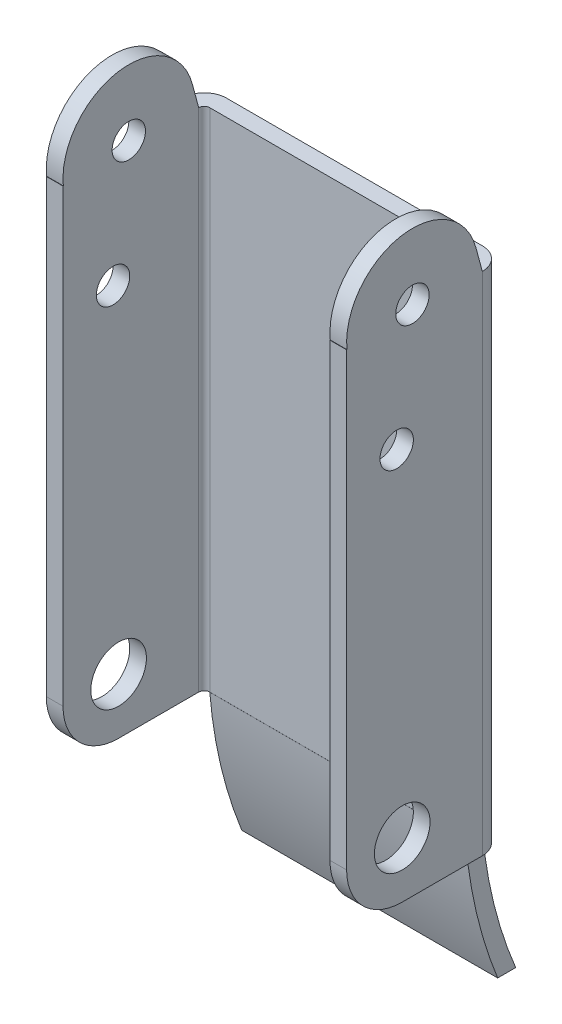
ISO-10303-21;
HEADER;
FILE_DESCRIPTION(('STEP AP214'),'2;1');
FILE_NAME('part.step','',(''),(''),'','','');
FILE_SCHEMA(('AUTOMOTIVE_DESIGN { 1 0 10303 214 1 1 1 1 }'));
ENDSEC;
DATA;
#1=APPLICATION_CONTEXT('core data for automotive mechanical design processes');
#2=APPLICATION_PROTOCOL_DEFINITION('international standard','automotive_design',2000,#1);
#3=PRODUCT_CONTEXT('',#1,'mechanical');
#4=PRODUCT('Part','Part','',(#3));
#5=PRODUCT_RELATED_PRODUCT_CATEGORY('part','',(#4));
#6=PRODUCT_DEFINITION_FORMATION('','',#4);
#7=PRODUCT_DEFINITION_CONTEXT('part definition',#1,'design');
#8=PRODUCT_DEFINITION('design','',#6,#7);
#9=PRODUCT_DEFINITION_SHAPE('','',#8);
#10=(LENGTH_UNIT() NAMED_UNIT(*) SI_UNIT(.MILLI.,.METRE.));
#11=(NAMED_UNIT(*) PLANE_ANGLE_UNIT() SI_UNIT($,.RADIAN.));
#12=(NAMED_UNIT(*) SI_UNIT($,.STERADIAN.) SOLID_ANGLE_UNIT());
#13=UNCERTAINTY_MEASURE_WITH_UNIT(LENGTH_MEASURE(1.E-05),#10,'distance_accuracy_value','');
#14=(GEOMETRIC_REPRESENTATION_CONTEXT(3) GLOBAL_UNCERTAINTY_ASSIGNED_CONTEXT((#13)) GLOBAL_UNIT_ASSIGNED_CONTEXT((#10,
#11,#12)) REPRESENTATION_CONTEXT('',''));
#15=CARTESIAN_POINT('',(0.,0.,0.));
#16=DIRECTION('',(0.,0.,1.));
#17=DIRECTION('',(1.,0.,0.));
#18=AXIS2_PLACEMENT_3D('',#15,#16,#17);
#19=CARTESIAN_POINT('',(11.5,0.,-12.2));
#20=DIRECTION('',(0.,1.,0.));
#21=DIRECTION('',(0.,0.,1.));
#22=AXIS2_PLACEMENT_3D('',#19,#20,#21);
#23=PLANE('',#22);
#24=DIRECTION('',(0.,0.,1.));
#25=VECTOR('',#24,1.);
#26=CARTESIAN_POINT('',(-11.5,0.,-12.6946454711369));
#27=LINE('',#26,#25);
#28=CARTESIAN_POINT('',(-11.5,0.,-14.2));
#29=VERTEX_POINT('',#28);
#30=CARTESIAN_POINT('',(-11.5,0.,-12.7));
#31=VERTEX_POINT('',#30);
#32=EDGE_CURVE('E183',#29,#31,#27,.T.);
#33=ORIENTED_EDGE('',*,*,#32,.T.);
#34=CARTESIAN_POINT('',(-11.5,0.,-12.2));
#35=DIRECTION('',(0.,-1.,0.));
#36=DIRECTION('',(0.,0.,1.));
#37=AXIS2_PLACEMENT_3D('',#34,#35,#36);
#38=CIRCLE('',#37,0.5);
#39=CARTESIAN_POINT('',(-12.,0.,-12.2));
#40=VERTEX_POINT('',#39);
#41=EDGE_CURVE('E355',#40,#31,#38,.T.);
#42=ORIENTED_EDGE('',*,*,#41,.F.);
#43=DIRECTION('',(0.,0.,-1.));
#44=VECTOR('',#43,1.);
#45=CARTESIAN_POINT('',(-12.,0.,0.));
#46=LINE('',#45,#44);
#47=CARTESIAN_POINT('',(-12.,0.,-5.00000000000004));
#48=VERTEX_POINT('',#47);
#49=EDGE_CURVE('E352',#48,#40,#46,.T.);
#50=ORIENTED_EDGE('',*,*,#49,.F.);
#51=DIRECTION('',(1.,0.,0.));
#52=VECTOR('',#51,1.);
#53=CARTESIAN_POINT('',(-26.,0.,-5.));
#54=LINE('',#53,#52);
#55=CARTESIAN_POINT('',(-13.5,0.,-5.));
#56=VERTEX_POINT('',#55);
#57=EDGE_CURVE('E391',#48,#56,#54,.F.);
#58=ORIENTED_EDGE('',*,*,#57,.T.);
#59=DIRECTION('',(0.,0.,1.));
#60=VECTOR('',#59,1.);
#61=CARTESIAN_POINT('',(-13.5,0.,0.));
#62=LINE('',#61,#60);
#63=CARTESIAN_POINT('',(-13.5,0.,-12.2));
#64=VERTEX_POINT('',#63);
#65=EDGE_CURVE('E186',#64,#56,#62,.T.);
#66=ORIENTED_EDGE('',*,*,#65,.F.);
#67=CARTESIAN_POINT('',(-11.5,0.,-12.2));
#68=DIRECTION('',(0.,1.,0.));
#69=DIRECTION('',(0.,0.,1.));
#70=AXIS2_PLACEMENT_3D('',#67,#68,#69);
#71=CIRCLE('',#70,2.);
#72=EDGE_CURVE('E179',#29,#64,#71,.T.);
#73=ORIENTED_EDGE('',*,*,#72,.F.);
#74=EDGE_LOOP('',(#33,#42,#50,#58,#66,#73));
#75=FACE_BOUND('',#74,.T.);
#76=ADVANCED_FACE('F35',(#75),#23,.F.);
#77=CARTESIAN_POINT('',(12.,52.,0.));
#78=DIRECTION('',(0.,0.,-1.));
#79=DIRECTION('',(-1.,0.,0.));
#80=AXIS2_PLACEMENT_3D('',#77,#78,#79);
#81=PLANE('',#80);
#82=DIRECTION('',(1.,0.,0.));
#83=VECTOR('',#82,1.);
#84=CARTESIAN_POINT('',(-26.,5.00000000000003,0.));
#85=LINE('',#84,#83);
#86=CARTESIAN_POINT('',(12.,5.00000000000003,0.));
#87=VERTEX_POINT('',#86);
#88=CARTESIAN_POINT('',(13.5,5.00000000000003,0.));
#89=VERTEX_POINT('',#88);
#90=EDGE_CURVE('E249',#87,#89,#85,.T.);
#91=ORIENTED_EDGE('',*,*,#90,.T.);
#92=DIRECTION('',(0.,-1.,0.));
#93=VECTOR('',#92,1.);
#94=CARTESIAN_POINT('',(13.5,52.,0.));
#95=LINE('',#94,#93);
#96=CARTESIAN_POINT('',(13.5,45.5,0.));
#97=VERTEX_POINT('',#96);
#98=EDGE_CURVE('E388',#97,#89,#95,.T.);
#99=ORIENTED_EDGE('',*,*,#98,.F.);
#100=DIRECTION('',(-1.,0.,0.));
#101=VECTOR('',#100,1.);
#102=CARTESIAN_POINT('',(12.,45.5,0.));
#103=LINE('',#102,#101);
#104=CARTESIAN_POINT('',(12.,45.5,0.));
#105=VERTEX_POINT('',#104);
#106=EDGE_CURVE('E279',#97,#105,#103,.T.);
#107=ORIENTED_EDGE('',*,*,#106,.T.);
#108=DIRECTION('',(0.,-1.,0.));
#109=VECTOR('',#108,1.);
#110=CARTESIAN_POINT('',(12.,52.,0.));
#111=LINE('',#110,#109);
#112=EDGE_CURVE('E367',#105,#87,#111,.T.);
#113=ORIENTED_EDGE('',*,*,#112,.T.);
#114=EDGE_LOOP('',(#91,#99,#107,#113));
#115=FACE_BOUND('',#114,.T.);
#116=ADVANCED_FACE('F37',(#115),#81,.F.);
#117=CARTESIAN_POINT('',(-12.,52.,0.));
#118=DIRECTION('',(0.,0.,-1.));
#119=DIRECTION('',(-1.,0.,0.));
#120=AXIS2_PLACEMENT_3D('',#117,#118,#119);
#121=PLANE('',#120);
#122=CARTESIAN_POINT('',(-13.5,5.00000000000003,0.));
#123=VERTEX_POINT('',#122);
#124=CARTESIAN_POINT('',(-12.,5.00000000000003,0.));
#125=VERTEX_POINT('',#124);
#126=EDGE_CURVE('E252',#123,#125,#85,.T.);
#127=ORIENTED_EDGE('',*,*,#126,.T.);
#128=DIRECTION('',(0.,-1.,0.));
#129=VECTOR('',#128,1.);
#130=CARTESIAN_POINT('',(-12.,52.,0.));
#131=LINE('',#130,#129);
#132=CARTESIAN_POINT('',(-12.,45.5,0.));
#133=VERTEX_POINT('',#132);
#134=EDGE_CURVE('E378',#133,#125,#131,.T.);
#135=ORIENTED_EDGE('',*,*,#134,.F.);
#136=DIRECTION('',(-1.,0.,0.));
#137=VECTOR('',#136,1.);
#138=CARTESIAN_POINT('',(-12.,45.5,0.));
#139=LINE('',#138,#137);
#140=CARTESIAN_POINT('',(-13.5,45.5,0.));
#141=VERTEX_POINT('',#140);
#142=EDGE_CURVE('E290',#133,#141,#139,.T.);
#143=ORIENTED_EDGE('',*,*,#142,.T.);
#144=DIRECTION('',(0.,-1.,0.));
#145=VECTOR('',#144,1.);
#146=CARTESIAN_POINT('',(-13.5,52.,0.));
#147=LINE('',#146,#145);
#148=EDGE_CURVE('E381',#141,#123,#147,.T.);
#149=ORIENTED_EDGE('',*,*,#148,.T.);
#150=EDGE_LOOP('',(#127,#135,#143,#149));
#151=FACE_BOUND('',#150,.T.);
#152=ADVANCED_FACE('F421',(#151),#121,.F.);
#153=CARTESIAN_POINT('',(13.5,52.,0.));
#154=DIRECTION('',(-1.,0.,0.));
#155=DIRECTION('',(0.,0.,1.));
#156=AXIS2_PLACEMENT_3D('',#153,#154,#155);
#157=PLANE('',#156);
#158=CARTESIAN_POINT('',(13.5,35.5,-4.5));
#159=DIRECTION('',(-1.,0.,0.));
#160=DIRECTION('',(0.,0.,1.));
#161=AXIS2_PLACEMENT_3D('',#158,#159,#160);
#162=CIRCLE('',#161,1.5);
#163=CARTESIAN_POINT('',(13.5,35.5,-3.));
#164=VERTEX_POINT('',#163);
#165=EDGE_CURVE('E332',#164,#164,#162,.T.);
#166=ORIENTED_EDGE('',*,*,#165,.T.);
#167=EDGE_LOOP('',(#166));
#168=FACE_BOUND('',#167,.T.);
#169=CARTESIAN_POINT('',(13.5,46.0824022264508,-5.91759777354919));
#170=DIRECTION('',(-1.,0.,0.));
#171=DIRECTION('',(0.,0.,1.));
#172=AXIS2_PLACEMENT_3D('',#169,#170,#171);
#173=CIRCLE('',#172,1.5);
#174=CARTESIAN_POINT('',(13.5,46.0824022264508,-4.41759777354919));
#175=VERTEX_POINT('',#174);
#176=EDGE_CURVE('E322',#175,#175,#173,.T.);
#177=ORIENTED_EDGE('',*,*,#176,.T.);
#178=EDGE_LOOP('',(#177));
#179=FACE_BOUND('',#178,.T.);
#180=CARTESIAN_POINT('',(13.5,5.,-5.));
#181=DIRECTION('',(-1.,0.,0.));
#182=DIRECTION('',(0.,0.,1.));
#183=AXIS2_PLACEMENT_3D('',#180,#181,#182);
#184=CIRCLE('',#183,2.5);
#185=CARTESIAN_POINT('',(13.5,5.,-2.5));
#186=VERTEX_POINT('',#185);
#187=EDGE_CURVE('E312',#186,#186,#184,.T.);
#188=ORIENTED_EDGE('',*,*,#187,.T.);
#189=EDGE_LOOP('',(#188));
#190=FACE_BOUND('',#189,.T.);
#191=ORIENTED_EDGE('',*,*,#98,.T.);
#192=CARTESIAN_POINT('',(13.5,5.,-5.));
#193=DIRECTION('',(-1.,0.,0.));
#194=DIRECTION('',(0.,0.,1.));
#195=AXIS2_PLACEMENT_3D('',#192,#193,#194);
#196=CIRCLE('',#195,5.);
#197=CARTESIAN_POINT('',(13.5,0.,-5.00000000000004));
#198=VERTEX_POINT('',#197);
#199=EDGE_CURVE('E271',#89,#198,#196,.F.);
#200=ORIENTED_EDGE('',*,*,#199,.T.);
#201=DIRECTION('',(0.,0.,-1.));
#202=VECTOR('',#201,1.);
#203=CARTESIAN_POINT('',(13.5,0.,0.));
#204=LINE('',#203,#202);
#205=CARTESIAN_POINT('',(13.5,0.,-12.2));
#206=VERTEX_POINT('',#205);
#207=EDGE_CURVE('E347',#198,#206,#204,.T.);
#208=ORIENTED_EDGE('',*,*,#207,.T.);
#209=DIRECTION('',(0.,-1.,0.));
#210=VECTOR('',#209,1.);
#211=CARTESIAN_POINT('',(13.5,52.,-12.2));
#212=LINE('',#211,#210);
#213=CARTESIAN_POINT('',(13.5,45.5,-12.2));
#214=VERTEX_POINT('',#213);
#215=EDGE_CURVE('E386',#214,#206,#212,.T.);
#216=ORIENTED_EDGE('',*,*,#215,.F.);
#217=DIRECTION('',(0.,0.96592582628907,0.258819045102515));
#218=VECTOR('',#217,1.);
#219=CARTESIAN_POINT('',(13.5,54.6145825622994,-9.75775496308514));
#220=LINE('',#219,#218);
#221=CARTESIAN_POINT('',(13.5,47.6139892315015,-11.6335582926111));
#222=VERTEX_POINT('',#221);
#223=EDGE_CURVE('E302',#214,#222,#220,.T.);
#224=ORIENTED_EDGE('',*,*,#223,.T.);
#225=CARTESIAN_POINT('',(13.5,46.0824022264508,-5.91759777354919));
#226=DIRECTION('',(-1.,0.,0.));
#227=DIRECTION('',(0.,0.,1.));
#228=AXIS2_PLACEMENT_3D('',#225,#226,#227);
#229=CIRCLE('',#228,5.91759777354919);
#230=CARTESIAN_POINT('',(13.5,45.5,-0.0287293715436352));
#231=VERTEX_POINT('',#230);
#232=EDGE_CURVE('E276',#222,#231,#229,.F.);
#233=ORIENTED_EDGE('',*,*,#232,.T.);
#234=DIRECTION('',(0.,0.,1.));
#235=VECTOR('',#234,1.);
#236=CARTESIAN_POINT('',(13.5,45.5,0.));
#237=LINE('',#236,#235);
#238=EDGE_CURVE('E284',#231,#97,#237,.T.);
#239=ORIENTED_EDGE('',*,*,#238,.T.);
#240=EDGE_LOOP('',(#191,#200,#208,#216,#224,#233,#239));
#241=FACE_BOUND('',#240,.T.);
#242=ADVANCED_FACE('F417',(#168,#179,#190,#241),#157,.F.);
#243=CARTESIAN_POINT('',(11.5,52.,-12.2));
#244=DIRECTION('',(0.,-1.,0.));
#245=DIRECTION('',(0.,0.,-1.));
#246=AXIS2_PLACEMENT_3D('',#243,#244,#245);
#247=CYLINDRICAL_SURFACE('',#246,2.);
#248=DIRECTION('',(0.,-1.,0.));
#249=VECTOR('',#248,1.);
#250=CARTESIAN_POINT('',(11.5,52.,-14.2));
#251=LINE('',#250,#249);
#252=CARTESIAN_POINT('',(11.5,45.5,-14.2));
#253=VERTEX_POINT('',#252);
#254=CARTESIAN_POINT('',(11.5,0.,-14.2));
#255=VERTEX_POINT('',#254);
#256=EDGE_CURVE('E200',#253,#255,#251,.T.);
#257=ORIENTED_EDGE('',*,*,#256,.F.);
#258=CARTESIAN_POINT('',(11.5,45.5,-12.2));
#259=DIRECTION('',(0.,-1.,0.));
#260=DIRECTION('',(0.,0.,-1.));
#261=AXIS2_PLACEMENT_3D('',#258,#259,#260);
#262=CIRCLE('',#261,2.);
#263=EDGE_CURVE('E344',#253,#214,#262,.T.);
#264=ORIENTED_EDGE('',*,*,#263,.T.);
#265=ORIENTED_EDGE('',*,*,#215,.T.);
#266=CARTESIAN_POINT('',(11.5,0.,-12.2));
#267=DIRECTION('',(0.,1.,0.));
#268=DIRECTION('',(0.,0.,1.));
#269=AXIS2_PLACEMENT_3D('',#266,#267,#268);
#270=CIRCLE('',#269,2.);
#271=EDGE_CURVE('E205',#206,#255,#270,.T.);
#272=ORIENTED_EDGE('',*,*,#271,.T.);
#273=EDGE_LOOP('',(#257,#264,#265,#272));
#274=FACE_BOUND('',#273,.T.);
#275=ADVANCED_FACE('F420',(#274),#247,.T.);
#276=CARTESIAN_POINT('',(11.5,52.,-14.2));
#277=DIRECTION('',(0.,0.,1.));
#278=DIRECTION('',(1.,0.,0.));
#279=AXIS2_PLACEMENT_3D('',#276,#277,#278);
#280=PLANE('',#279);
#281=DIRECTION('',(0.,-1.,0.));
#282=VECTOR('',#281,1.);
#283=CARTESIAN_POINT('',(-11.5,52.,-14.2));
#284=LINE('',#283,#282);
#285=CARTESIAN_POINT('',(-11.5,45.5,-14.2));
#286=VERTEX_POINT('',#285);
#287=EDGE_CURVE('E198',#286,#29,#284,.T.);
#288=ORIENTED_EDGE('',*,*,#287,.F.);
#289=DIRECTION('',(1.,0.,0.));
#290=VECTOR('',#289,1.);
#291=CARTESIAN_POINT('',(11.5,45.5,-14.2));
#292=LINE('',#291,#290);
#293=EDGE_CURVE('E342',#286,#253,#292,.T.);
#294=ORIENTED_EDGE('',*,*,#293,.T.);
#295=ORIENTED_EDGE('',*,*,#256,.T.);
#296=DIRECTION('',(-1.,0.,0.));
#297=VECTOR('',#296,1.);
#298=CARTESIAN_POINT('',(11.5,0.,-14.2));
#299=LINE('',#298,#297);
#300=EDGE_CURVE('E190',#255,#29,#299,.T.);
#301=ORIENTED_EDGE('',*,*,#300,.T.);
#302=EDGE_LOOP('',(#288,#294,#295,#301));
#303=FACE_BOUND('',#302,.T.);
#304=ADVANCED_FACE('F196',(#303),#280,.F.);
#305=CARTESIAN_POINT('',(-11.5,52.,-12.2));
#306=DIRECTION('',(0.,-1.,0.));
#307=DIRECTION('',(0.,0.,-1.));
#308=AXIS2_PLACEMENT_3D('',#305,#306,#307);
#309=CYLINDRICAL_SURFACE('',#308,2.);
#310=DIRECTION('',(0.,-1.,0.));
#311=VECTOR('',#310,1.);
#312=CARTESIAN_POINT('',(-13.5,52.,-12.2));
#313=LINE('',#312,#311);
#314=CARTESIAN_POINT('',(-13.5,45.5,-12.2));
#315=VERTEX_POINT('',#314);
#316=EDGE_CURVE('E210',#315,#64,#313,.T.);
#317=ORIENTED_EDGE('',*,*,#316,.F.);
#318=CARTESIAN_POINT('',(-11.5,45.5,-12.2));
#319=DIRECTION('',(0.,-1.,0.));
#320=DIRECTION('',(0.,0.,-1.));
#321=AXIS2_PLACEMENT_3D('',#318,#319,#320);
#322=CIRCLE('',#321,2.);
#323=EDGE_CURVE('E209',#315,#286,#322,.T.);
#324=ORIENTED_EDGE('',*,*,#323,.T.);
#325=ORIENTED_EDGE('',*,*,#287,.T.);
#326=ORIENTED_EDGE('',*,*,#72,.T.);
#327=EDGE_LOOP('',(#317,#324,#325,#326));
#328=FACE_BOUND('',#327,.T.);
#329=ADVANCED_FACE('F208',(#328),#309,.T.);
#330=CARTESIAN_POINT('',(-13.5,52.,0.));
#331=DIRECTION('',(1.,0.,0.));
#332=DIRECTION('',(0.,0.,-1.));
#333=AXIS2_PLACEMENT_3D('',#330,#331,#332);
#334=PLANE('',#333);
#335=CARTESIAN_POINT('',(-13.5,35.5,-4.5));
#336=DIRECTION('',(1.,0.,0.));
#337=DIRECTION('',(0.,0.,-1.));
#338=AXIS2_PLACEMENT_3D('',#335,#336,#337);
#339=CIRCLE('',#338,1.5);
#340=CARTESIAN_POINT('',(-13.5,35.5,-6.));
#341=VERTEX_POINT('',#340);
#342=EDGE_CURVE('E329',#341,#341,#339,.T.);
#343=ORIENTED_EDGE('',*,*,#342,.T.);
#344=EDGE_LOOP('',(#343));
#345=FACE_BOUND('',#344,.T.);
#346=CARTESIAN_POINT('',(-13.5,46.0824022264508,-5.91759777354919));
#347=DIRECTION('',(1.,0.,0.));
#348=DIRECTION('',(0.,0.,-1.));
#349=AXIS2_PLACEMENT_3D('',#346,#347,#348);
#350=CIRCLE('',#349,1.5);
#351=CARTESIAN_POINT('',(-13.5,46.0824022264508,-7.4175977735492));
#352=VERTEX_POINT('',#351);
#353=EDGE_CURVE('E319',#352,#352,#350,.T.);
#354=ORIENTED_EDGE('',*,*,#353,.T.);
#355=EDGE_LOOP('',(#354));
#356=FACE_BOUND('',#355,.T.);
#357=CARTESIAN_POINT('',(-13.5,5.,-5.));
#358=DIRECTION('',(1.,0.,0.));
#359=DIRECTION('',(0.,0.,-1.));
#360=AXIS2_PLACEMENT_3D('',#357,#358,#359);
#361=CIRCLE('',#360,2.5);
#362=CARTESIAN_POINT('',(-13.5,5.,-7.5));
#363=VERTEX_POINT('',#362);
#364=EDGE_CURVE('E309',#363,#363,#361,.T.);
#365=ORIENTED_EDGE('',*,*,#364,.T.);
#366=EDGE_LOOP('',(#365));
#367=FACE_BOUND('',#366,.T.);
#368=ORIENTED_EDGE('',*,*,#65,.T.);
#369=CARTESIAN_POINT('',(-13.5,5.,-5.));
#370=DIRECTION('',(1.,0.,0.));
#371=DIRECTION('',(0.,0.,-1.));
#372=AXIS2_PLACEMENT_3D('',#369,#370,#371);
#373=CIRCLE('',#372,5.);
#374=EDGE_CURVE('E58',#56,#123,#373,.F.);
#375=ORIENTED_EDGE('',*,*,#374,.T.);
#376=ORIENTED_EDGE('',*,*,#148,.F.);
#377=DIRECTION('',(0.,0.,-1.));
#378=VECTOR('',#377,1.);
#379=CARTESIAN_POINT('',(-13.5,45.5,0.));
#380=LINE('',#379,#378);
#381=CARTESIAN_POINT('',(-13.5,45.5,-0.0287293715436352));
#382=VERTEX_POINT('',#381);
#383=EDGE_CURVE('E293',#141,#382,#380,.T.);
#384=ORIENTED_EDGE('',*,*,#383,.T.);
#385=CARTESIAN_POINT('',(-13.5,46.0824022264508,-5.91759777354919));
#386=DIRECTION('',(1.,0.,0.));
#387=DIRECTION('',(0.,0.,-1.));
#388=AXIS2_PLACEMENT_3D('',#385,#386,#387);
#389=CIRCLE('',#388,5.91759777354919);
#390=CARTESIAN_POINT('',(-13.5,47.6139892315015,-11.6335582926111));
#391=VERTEX_POINT('',#390);
#392=EDGE_CURVE('E277',#382,#391,#389,.F.);
#393=ORIENTED_EDGE('',*,*,#392,.T.);
#394=DIRECTION('',(0.,-0.96592582628907,-0.258819045102515));
#395=VECTOR('',#394,1.);
#396=CARTESIAN_POINT('',(-13.5,54.6145825622994,-9.75775496308514));
#397=LINE('',#396,#395);
#398=EDGE_CURVE('E299',#391,#315,#397,.T.);
#399=ORIENTED_EDGE('',*,*,#398,.T.);
#400=ORIENTED_EDGE('',*,*,#316,.T.);
#401=EDGE_LOOP('',(#368,#375,#376,#384,#393,#399,#400));
#402=FACE_BOUND('',#401,.T.);
#403=ADVANCED_FACE('F506',(#345,#356,#367,#402),#334,.F.);
#404=CARTESIAN_POINT('',(-12.,52.,0.));
#405=DIRECTION('',(-1.,0.,0.));
#406=DIRECTION('',(0.,0.,1.));
#407=AXIS2_PLACEMENT_3D('',#404,#405,#406);
#408=PLANE('',#407);
#409=CARTESIAN_POINT('',(-12.,35.5,-4.5));
#410=DIRECTION('',(-1.,0.,0.));
#411=DIRECTION('',(0.,0.,1.));
#412=AXIS2_PLACEMENT_3D('',#409,#410,#411);
#413=CIRCLE('',#412,1.5);
#414=CARTESIAN_POINT('',(-12.,35.5,-3.));
#415=VERTEX_POINT('',#414);
#416=EDGE_CURVE('E326',#415,#415,#413,.T.);
#417=ORIENTED_EDGE('',*,*,#416,.T.);
#418=EDGE_LOOP('',(#417));
#419=FACE_BOUND('',#418,.T.);
#420=CARTESIAN_POINT('',(-12.,46.0824022264508,-5.91759777354919));
#421=DIRECTION('',(-1.,0.,0.));
#422=DIRECTION('',(0.,0.,1.));
#423=AXIS2_PLACEMENT_3D('',#420,#421,#422);
#424=CIRCLE('',#423,1.5);
#425=CARTESIAN_POINT('',(-12.,46.0824022264508,-4.41759777354919));
#426=VERTEX_POINT('',#425);
#427=EDGE_CURVE('E316',#426,#426,#424,.T.);
#428=ORIENTED_EDGE('',*,*,#427,.T.);
#429=EDGE_LOOP('',(#428));
#430=FACE_BOUND('',#429,.T.);
#431=CARTESIAN_POINT('',(-12.,5.,-5.));
#432=DIRECTION('',(-1.,0.,0.));
#433=DIRECTION('',(0.,0.,1.));
#434=AXIS2_PLACEMENT_3D('',#431,#432,#433);
#435=CIRCLE('',#434,2.5);
#436=CARTESIAN_POINT('',(-12.,5.,-2.5));
#437=VERTEX_POINT('',#436);
#438=EDGE_CURVE('E306',#437,#437,#435,.T.);
#439=ORIENTED_EDGE('',*,*,#438,.T.);
#440=EDGE_LOOP('',(#439));
#441=FACE_BOUND('',#440,.T.);
#442=ORIENTED_EDGE('',*,*,#134,.T.);
#443=CARTESIAN_POINT('',(-12.,5.,-5.));
#444=DIRECTION('',(-1.,0.,0.));
#445=DIRECTION('',(0.,0.,1.));
#446=AXIS2_PLACEMENT_3D('',#443,#444,#445);
#447=CIRCLE('',#446,5.);
#448=EDGE_CURVE('E267',#125,#48,#447,.F.);
#449=ORIENTED_EDGE('',*,*,#448,.T.);
#450=ORIENTED_EDGE('',*,*,#49,.T.);
#451=DIRECTION('',(0.,-1.,0.));
#452=VECTOR('',#451,1.);
#453=CARTESIAN_POINT('',(-12.,52.,-12.2));
#454=LINE('',#453,#452);
#455=CARTESIAN_POINT('',(-12.,45.5,-12.2));
#456=VERTEX_POINT('',#455);
#457=EDGE_CURVE('E376',#456,#40,#454,.T.);
#458=ORIENTED_EDGE('',*,*,#457,.F.);
#459=DIRECTION('',(0.,0.96592582628907,0.258819045102515));
#460=VECTOR('',#459,1.);
#461=CARTESIAN_POINT('',(-12.,54.6145825622994,-9.75775496308514));
#462=LINE('',#461,#460);
#463=CARTESIAN_POINT('',(-12.,47.6139892315015,-11.6335582926111));
#464=VERTEX_POINT('',#463);
#465=EDGE_CURVE('E296',#456,#464,#462,.T.);
#466=ORIENTED_EDGE('',*,*,#465,.T.);
#467=CARTESIAN_POINT('',(-12.,46.0824022264508,-5.91759777354919));
#468=DIRECTION('',(-1.,0.,0.));
#469=DIRECTION('',(0.,0.,1.));
#470=AXIS2_PLACEMENT_3D('',#467,#468,#469);
#471=CIRCLE('',#470,5.91759777354919);
#472=CARTESIAN_POINT('',(-12.,45.5,-0.0287293715436352));
#473=VERTEX_POINT('',#472);
#474=EDGE_CURVE('E274',#464,#473,#471,.F.);
#475=ORIENTED_EDGE('',*,*,#474,.T.);
#476=DIRECTION('',(0.,0.,1.));
#477=VECTOR('',#476,1.);
#478=CARTESIAN_POINT('',(-12.,45.5,0.));
#479=LINE('',#478,#477);
#480=EDGE_CURVE('E287',#473,#133,#479,.T.);
#481=ORIENTED_EDGE('',*,*,#480,.T.);
#482=EDGE_LOOP('',(#442,#449,#450,#458,#466,#475,#481));
#483=FACE_BOUND('',#482,.T.);
#484=ADVANCED_FACE('F502',(#419,#430,#441,#483),#408,.F.);
#485=CARTESIAN_POINT('',(-11.5,52.,-12.2));
#486=DIRECTION('',(0.,-1.,0.));
#487=DIRECTION('',(0.,0.,-1.));
#488=AXIS2_PLACEMENT_3D('',#485,#486,#487);
#489=CYLINDRICAL_SURFACE('',#488,0.5);
#490=DIRECTION('',(0.,-1.,0.));
#491=VECTOR('',#490,1.);
#492=CARTESIAN_POINT('',(-11.5,52.,-12.7));
#493=LINE('',#492,#491);
#494=CARTESIAN_POINT('',(-11.5,45.5,-12.7));
#495=VERTEX_POINT('',#494);
#496=EDGE_CURVE('E374',#495,#31,#493,.T.);
#497=ORIENTED_EDGE('',*,*,#496,.F.);
#498=CARTESIAN_POINT('',(-11.5,45.5,-12.2));
#499=DIRECTION('',(0.,-1.,0.));
#500=DIRECTION('',(0.,0.,-1.));
#501=AXIS2_PLACEMENT_3D('',#498,#499,#500);
#502=CIRCLE('',#501,0.5);
#503=EDGE_CURVE('E338',#495,#456,#502,.F.);
#504=ORIENTED_EDGE('',*,*,#503,.T.);
#505=ORIENTED_EDGE('',*,*,#457,.T.);
#506=ORIENTED_EDGE('',*,*,#41,.T.);
#507=EDGE_LOOP('',(#497,#504,#505,#506));
#508=FACE_BOUND('',#507,.T.);
#509=ADVANCED_FACE('F499',(#508),#489,.F.);
#510=CARTESIAN_POINT('',(11.5,52.,-12.7));
#511=DIRECTION('',(0.,0.,-1.));
#512=DIRECTION('',(-1.,0.,0.));
#513=AXIS2_PLACEMENT_3D('',#510,#511,#512);
#514=PLANE('',#513);
#515=DIRECTION('',(0.,-1.,0.));
#516=VECTOR('',#515,1.);
#517=CARTESIAN_POINT('',(11.5,52.,-12.7));
#518=LINE('',#517,#516);
#519=CARTESIAN_POINT('',(11.5,45.5,-12.7));
#520=VERTEX_POINT('',#519);
#521=CARTESIAN_POINT('',(11.5,0.,-12.7));
#522=VERTEX_POINT('',#521);
#523=EDGE_CURVE('E372',#520,#522,#518,.T.);
#524=ORIENTED_EDGE('',*,*,#523,.F.);
#525=DIRECTION('',(-1.,0.,0.));
#526=VECTOR('',#525,1.);
#527=CARTESIAN_POINT('',(11.5,45.5,-12.7));
#528=LINE('',#527,#526);
#529=EDGE_CURVE('E335',#520,#495,#528,.T.);
#530=ORIENTED_EDGE('',*,*,#529,.T.);
#531=ORIENTED_EDGE('',*,*,#496,.T.);
#532=DIRECTION('',(1.,0.,0.));
#533=VECTOR('',#532,1.);
#534=CARTESIAN_POINT('',(11.5,0.,-12.7));
#535=LINE('',#534,#533);
#536=EDGE_CURVE('E358',#31,#522,#535,.T.);
#537=ORIENTED_EDGE('',*,*,#536,.T.);
#538=EDGE_LOOP('',(#524,#530,#531,#537));
#539=FACE_BOUND('',#538,.T.);
#540=ADVANCED_FACE('F455',(#539),#514,.F.);
#541=CARTESIAN_POINT('',(11.5,52.,-12.2));
#542=DIRECTION('',(0.,-1.,0.));
#543=DIRECTION('',(0.,0.,-1.));
#544=AXIS2_PLACEMENT_3D('',#541,#542,#543);
#545=CYLINDRICAL_SURFACE('',#544,0.5);
#546=DIRECTION('',(0.,-1.,0.));
#547=VECTOR('',#546,1.);
#548=CARTESIAN_POINT('',(12.,52.,-12.2));
#549=LINE('',#548,#547);
#550=CARTESIAN_POINT('',(12.,45.5,-12.2));
#551=VERTEX_POINT('',#550);
#552=CARTESIAN_POINT('',(12.,0.,-12.2));
#553=VERTEX_POINT('',#552);
#554=EDGE_CURVE('E370',#551,#553,#549,.T.);
#555=ORIENTED_EDGE('',*,*,#554,.F.);
#556=CARTESIAN_POINT('',(11.5,45.5,-12.2));
#557=DIRECTION('',(0.,-1.,0.));
#558=DIRECTION('',(0.,0.,-1.));
#559=AXIS2_PLACEMENT_3D('',#556,#557,#558);
#560=CIRCLE('',#559,0.5);
#561=EDGE_CURVE('E11',#551,#520,#560,.F.);
#562=ORIENTED_EDGE('',*,*,#561,.T.);
#563=ORIENTED_EDGE('',*,*,#523,.T.);
#564=CARTESIAN_POINT('',(11.5,0.,-12.2));
#565=DIRECTION('',(0.,-1.,0.));
#566=DIRECTION('',(0.,0.,1.));
#567=AXIS2_PLACEMENT_3D('',#564,#565,#566);
#568=CIRCLE('',#567,0.5);
#569=EDGE_CURVE('E361',#522,#553,#568,.T.);
#570=ORIENTED_EDGE('',*,*,#569,.T.);
#571=EDGE_LOOP('',(#555,#562,#563,#570));
#572=FACE_BOUND('',#571,.T.);
#573=ADVANCED_FACE('F451',(#572),#545,.F.);
#574=CARTESIAN_POINT('',(12.,52.,0.));
#575=DIRECTION('',(1.,0.,0.));
#576=DIRECTION('',(0.,0.,-1.));
#577=AXIS2_PLACEMENT_3D('',#574,#575,#576);
#578=PLANE('',#577);
#579=CARTESIAN_POINT('',(12.,35.5,-4.5));
#580=DIRECTION('',(1.,0.,0.));
#581=DIRECTION('',(0.,0.,-1.));
#582=AXIS2_PLACEMENT_3D('',#579,#580,#581);
#583=CIRCLE('',#582,1.5);
#584=CARTESIAN_POINT('',(12.,35.5,-6.));
#585=VERTEX_POINT('',#584);
#586=EDGE_CURVE('E325',#585,#585,#583,.T.);
#587=ORIENTED_EDGE('',*,*,#586,.T.);
#588=EDGE_LOOP('',(#587));
#589=FACE_BOUND('',#588,.T.);
#590=CARTESIAN_POINT('',(12.,46.0824022264508,-5.91759777354919));
#591=DIRECTION('',(1.,0.,0.));
#592=DIRECTION('',(0.,0.,-1.));
#593=AXIS2_PLACEMENT_3D('',#590,#591,#592);
#594=CIRCLE('',#593,1.5);
#595=CARTESIAN_POINT('',(12.,46.0824022264508,-7.4175977735492));
#596=VERTEX_POINT('',#595);
#597=EDGE_CURVE('E315',#596,#596,#594,.T.);
#598=ORIENTED_EDGE('',*,*,#597,.T.);
#599=EDGE_LOOP('',(#598));
#600=FACE_BOUND('',#599,.T.);
#601=CARTESIAN_POINT('',(12.,5.,-5.));
#602=DIRECTION('',(1.,0.,0.));
#603=DIRECTION('',(0.,0.,-1.));
#604=AXIS2_PLACEMENT_3D('',#601,#602,#603);
#605=CIRCLE('',#604,2.5);
#606=CARTESIAN_POINT('',(12.,5.,-7.5));
#607=VERTEX_POINT('',#606);
#608=EDGE_CURVE('E305',#607,#607,#605,.T.);
#609=ORIENTED_EDGE('',*,*,#608,.T.);
#610=EDGE_LOOP('',(#609));
#611=FACE_BOUND('',#610,.T.);
#612=DIRECTION('',(0.,0.,1.));
#613=VECTOR('',#612,1.);
#614=CARTESIAN_POINT('',(12.,0.,0.));
#615=LINE('',#614,#613);
#616=CARTESIAN_POINT('',(12.,0.,-5.));
#617=VERTEX_POINT('',#616);
#618=EDGE_CURVE('E364',#553,#617,#615,.T.);
#619=ORIENTED_EDGE('',*,*,#618,.T.);
#620=CARTESIAN_POINT('',(12.,5.,-5.));
#621=DIRECTION('',(1.,0.,0.));
#622=DIRECTION('',(0.,0.,-1.));
#623=AXIS2_PLACEMENT_3D('',#620,#621,#622);
#624=CIRCLE('',#623,5.);
#625=EDGE_CURVE('E264',#617,#87,#624,.F.);
#626=ORIENTED_EDGE('',*,*,#625,.T.);
#627=ORIENTED_EDGE('',*,*,#112,.F.);
#628=DIRECTION('',(0.,0.,-1.));
#629=VECTOR('',#628,1.);
#630=CARTESIAN_POINT('',(12.,45.5,0.));
#631=LINE('',#630,#629);
#632=CARTESIAN_POINT('',(12.,45.5,-0.0287293715436352));
#633=VERTEX_POINT('',#632);
#634=EDGE_CURVE('E394',#105,#633,#631,.T.);
#635=ORIENTED_EDGE('',*,*,#634,.T.);
#636=CARTESIAN_POINT('',(12.,46.0824022264508,-5.91759777354919));
#637=DIRECTION('',(1.,0.,0.));
#638=DIRECTION('',(0.,0.,-1.));
#639=AXIS2_PLACEMENT_3D('',#636,#637,#638);
#640=CIRCLE('',#639,5.91759777354919);
#641=CARTESIAN_POINT('',(12.,47.6139892315015,-11.6335582926111));
#642=VERTEX_POINT('',#641);
#643=EDGE_CURVE('E50',#633,#642,#640,.F.);
#644=ORIENTED_EDGE('',*,*,#643,.T.);
#645=DIRECTION('',(0.,-0.96592582628907,-0.258819045102515));
#646=VECTOR('',#645,1.);
#647=CARTESIAN_POINT('',(12.,54.6145825622994,-9.75775496308514));
#648=LINE('',#647,#646);
#649=EDGE_CURVE('E43',#642,#551,#648,.T.);
#650=ORIENTED_EDGE('',*,*,#649,.T.);
#651=ORIENTED_EDGE('',*,*,#554,.T.);
#652=EDGE_LOOP('',(#619,#626,#627,#635,#644,#650,#651));
#653=FACE_BOUND('',#652,.T.);
#654=ADVANCED_FACE('F405',(#589,#600,#611,#653),#578,.F.);
#655=ORIENTED_EDGE('',*,*,#569,.F.);
#656=DIRECTION('',(0.,0.,1.));
#657=VECTOR('',#656,1.);
#658=CARTESIAN_POINT('',(11.5,0.,-12.6946454711369));
#659=LINE('',#658,#657);
#660=EDGE_CURVE('E236',#255,#522,#659,.T.);
#661=ORIENTED_EDGE('',*,*,#660,.F.);
#662=ORIENTED_EDGE('',*,*,#271,.F.);
#663=ORIENTED_EDGE('',*,*,#207,.F.);
#664=EDGE_CURVE('E393',#198,#617,#54,.F.);
#665=ORIENTED_EDGE('',*,*,#664,.T.);
#666=ORIENTED_EDGE('',*,*,#618,.F.);
#667=EDGE_LOOP('',(#655,#661,#662,#663,#665,#666));
#668=FACE_BOUND('',#667,.T.);
#669=ADVANCED_FACE('F439',(#668),#23,.F.);
#670=CARTESIAN_POINT('',(-26.,5.,-5.));
#671=DIRECTION('',(1.,0.,0.));
#672=DIRECTION('',(0.,0.,-1.));
#673=AXIS2_PLACEMENT_3D('',#670,#671,#672);
#674=CYLINDRICAL_SURFACE('',#673,5.);
#675=ORIENTED_EDGE('',*,*,#57,.F.);
#676=ORIENTED_EDGE('',*,*,#448,.F.);
#677=ORIENTED_EDGE('',*,*,#126,.F.);
#678=ORIENTED_EDGE('',*,*,#374,.F.);
#679=EDGE_LOOP('',(#675,#676,#677,#678));
#680=FACE_BOUND('',#679,.T.);
#681=ADVANCED_FACE('F486',(#680),#674,.T.);
#682=ORIENTED_EDGE('',*,*,#90,.F.);
#683=ORIENTED_EDGE('',*,*,#625,.F.);
#684=ORIENTED_EDGE('',*,*,#664,.F.);
#685=ORIENTED_EDGE('',*,*,#199,.F.);
#686=EDGE_LOOP('',(#682,#683,#684,#685));
#687=FACE_BOUND('',#686,.T.);
#688=ADVANCED_FACE('F432',(#687),#674,.T.);
#689=CARTESIAN_POINT('',(-26.,45.5,-12.2));
#690=DIRECTION('',(0.,-1.,0.));
#691=DIRECTION('',(0.,0.,-1.));
#692=AXIS2_PLACEMENT_3D('',#689,#690,#691);
#693=PLANE('',#692);
#694=ORIENTED_EDGE('',*,*,#293,.F.);
#695=ORIENTED_EDGE('',*,*,#323,.F.);
#696=DIRECTION('',(1.,0.,0.));
#697=VECTOR('',#696,1.);
#698=CARTESIAN_POINT('',(-26.,45.5,-12.2));
#699=LINE('',#698,#697);
#700=EDGE_CURVE('E256',#315,#456,#699,.T.);
#701=ORIENTED_EDGE('',*,*,#700,.T.);
#702=ORIENTED_EDGE('',*,*,#503,.F.);
#703=ORIENTED_EDGE('',*,*,#529,.F.);
#704=ORIENTED_EDGE('',*,*,#561,.F.);
#705=EDGE_CURVE('E253',#551,#214,#699,.T.);
#706=ORIENTED_EDGE('',*,*,#705,.T.);
#707=ORIENTED_EDGE('',*,*,#263,.F.);
#708=EDGE_LOOP('',(#694,#695,#701,#702,#703,#704,#706,#707));
#709=FACE_BOUND('',#708,.T.);
#710=ADVANCED_FACE('F445',(#709),#693,.F.);
#711=CARTESIAN_POINT('',(-26.,45.5,-12.2));
#712=DIRECTION('',(0.,-0.258819045102515,0.96592582628907));
#713=DIRECTION('',(0.,-0.96592582628907,-0.258819045102515));
#714=AXIS2_PLACEMENT_3D('',#711,#712,#713);
#715=PLANE('',#714);
#716=ORIENTED_EDGE('',*,*,#705,.F.);
#717=ORIENTED_EDGE('',*,*,#649,.F.);
#718=DIRECTION('',(1.,0.,0.));
#719=VECTOR('',#718,1.);
#720=CARTESIAN_POINT('',(-26.,47.6139892315015,-11.6335582926111));
#721=LINE('',#720,#719);
#722=EDGE_CURVE('E258',#642,#222,#721,.T.);
#723=ORIENTED_EDGE('',*,*,#722,.T.);
#724=ORIENTED_EDGE('',*,*,#223,.F.);
#725=EDGE_LOOP('',(#716,#717,#723,#724));
#726=FACE_BOUND('',#725,.T.);
#727=ADVANCED_FACE('F449',(#726),#715,.F.);
#728=EDGE_CURVE('E257',#391,#464,#721,.T.);
#729=ORIENTED_EDGE('',*,*,#728,.T.);
#730=ORIENTED_EDGE('',*,*,#465,.F.);
#731=ORIENTED_EDGE('',*,*,#700,.F.);
#732=ORIENTED_EDGE('',*,*,#398,.F.);
#733=EDGE_LOOP('',(#729,#730,#731,#732));
#734=FACE_BOUND('',#733,.T.);
#735=ADVANCED_FACE('F666',(#734),#715,.F.);
#736=CARTESIAN_POINT('',(-26.,45.5,2.33082971831327));
#737=DIRECTION('',(0.,-1.,0.));
#738=DIRECTION('',(0.,0.,-1.));
#739=AXIS2_PLACEMENT_3D('',#736,#737,#738);
#740=PLANE('',#739);
#741=ORIENTED_EDGE('',*,*,#142,.F.);
#742=ORIENTED_EDGE('',*,*,#480,.F.);
#743=DIRECTION('',(1.,0.,0.));
#744=VECTOR('',#743,1.);
#745=CARTESIAN_POINT('',(-26.,45.5,-0.0287293715436352));
#746=LINE('',#745,#744);
#747=EDGE_CURVE('E261',#382,#473,#746,.T.);
#748=ORIENTED_EDGE('',*,*,#747,.F.);
#749=ORIENTED_EDGE('',*,*,#383,.F.);
#750=EDGE_LOOP('',(#741,#742,#748,#749));
#751=FACE_BOUND('',#750,.T.);
#752=ADVANCED_FACE('F658',(#751),#740,.F.);
#753=EDGE_CURVE('E262',#633,#231,#746,.T.);
#754=ORIENTED_EDGE('',*,*,#753,.F.);
#755=ORIENTED_EDGE('',*,*,#634,.F.);
#756=ORIENTED_EDGE('',*,*,#106,.F.);
#757=ORIENTED_EDGE('',*,*,#238,.F.);
#758=EDGE_LOOP('',(#754,#755,#756,#757));
#759=FACE_BOUND('',#758,.T.);
#760=ADVANCED_FACE('F652',(#759),#740,.F.);
#761=CARTESIAN_POINT('',(-26.,46.0824022264508,-5.91759777354919));
#762=DIRECTION('',(1.,0.,0.));
#763=DIRECTION('',(0.,0.,-1.));
#764=AXIS2_PLACEMENT_3D('',#761,#762,#763);
#765=CYLINDRICAL_SURFACE('',#764,5.91759777354919);
#766=ORIENTED_EDGE('',*,*,#232,.F.);
#767=ORIENTED_EDGE('',*,*,#722,.F.);
#768=ORIENTED_EDGE('',*,*,#643,.F.);
#769=ORIENTED_EDGE('',*,*,#753,.T.);
#770=EDGE_LOOP('',(#766,#767,#768,#769));
#771=FACE_BOUND('',#770,.T.);
#772=ADVANCED_FACE('F644',(#771),#765,.T.);
#773=ORIENTED_EDGE('',*,*,#392,.F.);
#774=ORIENTED_EDGE('',*,*,#747,.T.);
#775=ORIENTED_EDGE('',*,*,#474,.F.);
#776=ORIENTED_EDGE('',*,*,#728,.F.);
#777=EDGE_LOOP('',(#773,#774,#775,#776));
#778=FACE_BOUND('',#777,.T.);
#779=ADVANCED_FACE('F637',(#778),#765,.T.);
#780=CARTESIAN_POINT('',(-26.,5.,-5.));
#781=DIRECTION('',(1.,0.,0.));
#782=DIRECTION('',(0.,0.,-1.));
#783=AXIS2_PLACEMENT_3D('',#780,#781,#782);
#784=CYLINDRICAL_SURFACE('',#783,2.5);
#785=ORIENTED_EDGE('',*,*,#608,.F.);
#786=EDGE_LOOP('',(#785));
#787=FACE_BOUND('',#786,.T.);
#788=ORIENTED_EDGE('',*,*,#187,.F.);
#789=EDGE_LOOP('',(#788));
#790=FACE_BOUND('',#789,.T.);
#791=ADVANCED_FACE('F620',(#787,#790),#784,.F.);
#792=CARTESIAN_POINT('',(-26.,46.0824022264508,-5.91759777354919));
#793=DIRECTION('',(1.,0.,0.));
#794=DIRECTION('',(0.,0.,-1.));
#795=AXIS2_PLACEMENT_3D('',#792,#793,#794);
#796=CYLINDRICAL_SURFACE('',#795,1.5);
#797=ORIENTED_EDGE('',*,*,#597,.F.);
#798=EDGE_LOOP('',(#797));
#799=FACE_BOUND('',#798,.T.);
#800=ORIENTED_EDGE('',*,*,#176,.F.);
#801=EDGE_LOOP('',(#800));
#802=FACE_BOUND('',#801,.T.);
#803=ADVANCED_FACE('F412',(#799,#802),#796,.F.);
#804=CARTESIAN_POINT('',(-26.,35.5,-4.5));
#805=DIRECTION('',(1.,0.,0.));
#806=DIRECTION('',(0.,0.,-1.));
#807=AXIS2_PLACEMENT_3D('',#804,#805,#806);
#808=CYLINDRICAL_SURFACE('',#807,1.5);
#809=ORIENTED_EDGE('',*,*,#586,.F.);
#810=EDGE_LOOP('',(#809));
#811=FACE_BOUND('',#810,.T.);
#812=ORIENTED_EDGE('',*,*,#165,.F.);
#813=EDGE_LOOP('',(#812));
#814=FACE_BOUND('',#813,.T.);
#815=ADVANCED_FACE('F408',(#811,#814),#808,.F.);
#816=ORIENTED_EDGE('',*,*,#438,.F.);
#817=EDGE_LOOP('',(#816));
#818=FACE_BOUND('',#817,.T.);
#819=ORIENTED_EDGE('',*,*,#364,.F.);
#820=EDGE_LOOP('',(#819));
#821=FACE_BOUND('',#820,.T.);
#822=ADVANCED_FACE('F411',(#818,#821),#784,.F.);
#823=ORIENTED_EDGE('',*,*,#427,.F.);
#824=EDGE_LOOP('',(#823));
#825=FACE_BOUND('',#824,.T.);
#826=ORIENTED_EDGE('',*,*,#353,.F.);
#827=EDGE_LOOP('',(#826));
#828=FACE_BOUND('',#827,.T.);
#829=ADVANCED_FACE('F605',(#825,#828),#796,.F.);
#830=ORIENTED_EDGE('',*,*,#416,.F.);
#831=EDGE_LOOP('',(#830));
#832=FACE_BOUND('',#831,.T.);
#833=ORIENTED_EDGE('',*,*,#342,.F.);
#834=EDGE_LOOP('',(#833));
#835=FACE_BOUND('',#834,.T.);
#836=ADVANCED_FACE('F414',(#832,#835),#808,.F.);
#837=CARTESIAN_POINT('',(11.5,0.,-12.6946454711369));
#838=DIRECTION('',(0.,-1.,0.));
#839=DIRECTION('',(0.,0.,-1.));
#840=AXIS2_PLACEMENT_3D('',#837,#838,#839);
#841=PLANE('',#840);
#842=CARTESIAN_POINT('',(11.5,0.,-12.6946454711369));
#843=VERTEX_POINT('',#842);
#844=EDGE_CURVE('E235',#522,#843,#659,.T.);
#845=ORIENTED_EDGE('',*,*,#844,.F.);
#846=ORIENTED_EDGE('',*,*,#536,.F.);
#847=CARTESIAN_POINT('',(-11.5,0.,-12.6946454711369));
#848=VERTEX_POINT('',#847);
#849=EDGE_CURVE('E220',#31,#848,#27,.T.);
#850=ORIENTED_EDGE('',*,*,#849,.T.);
#851=DIRECTION('',(-1.,0.,0.));
#852=VECTOR('',#851,1.);
#853=CARTESIAN_POINT('',(11.5,0.,-12.6946454711369));
#854=LINE('',#853,#852);
#855=EDGE_CURVE('E246',#843,#848,#854,.T.);
#856=ORIENTED_EDGE('',*,*,#855,.F.);
#857=EDGE_LOOP('',(#845,#846,#850,#856));
#858=FACE_BOUND('',#857,.T.);
#859=ADVANCED_FACE('F458',(#858),#841,.F.);
#860=CARTESIAN_POINT('',(11.5,3.48711612845763,-54.687546415734));
#861=DIRECTION('',(-1.,0.,0.));
#862=DIRECTION('',(0.,0.,1.));
#863=AXIS2_PLACEMENT_3D('',#860,#861,#862);
#864=CYLINDRICAL_SURFACE('',#863,40.6374383255092);
#865=DIRECTION('',(-1.,0.,0.));
#866=VECTOR('',#865,1.);
#867=CARTESIAN_POINT('',(11.5,-12.2,-17.2000047354391));
#868=LINE('',#867,#866);
#869=CARTESIAN_POINT('',(11.5,-12.2,-17.2000047354391));
#870=VERTEX_POINT('',#869);
#871=CARTESIAN_POINT('',(-11.5,-12.2,-17.2000047354391));
#872=VERTEX_POINT('',#871);
#873=EDGE_CURVE('E225',#870,#872,#868,.T.);
#874=ORIENTED_EDGE('',*,*,#873,.T.);
#875=CARTESIAN_POINT('',(-11.5,3.48711612845763,-54.687546415734));
#876=DIRECTION('',(-1.,0.,0.));
#877=DIRECTION('',(0.,0.,-1.));
#878=AXIS2_PLACEMENT_3D('',#875,#876,#877);
#879=CIRCLE('',#878,40.6374383255092);
#880=EDGE_CURVE('E217',#872,#29,#879,.T.);
#881=ORIENTED_EDGE('',*,*,#880,.T.);
#882=ORIENTED_EDGE('',*,*,#300,.F.);
#883=CARTESIAN_POINT('',(11.5,3.48711612845763,-54.687546415734));
#884=DIRECTION('',(-1.,0.,0.));
#885=DIRECTION('',(0.,0.,-1.));
#886=AXIS2_PLACEMENT_3D('',#883,#884,#885);
#887=CIRCLE('',#886,40.6374383255092);
#888=EDGE_CURVE('E232',#870,#255,#887,.T.);
#889=ORIENTED_EDGE('',*,*,#888,.F.);
#890=EDGE_LOOP('',(#874,#881,#882,#889));
#891=FACE_BOUND('',#890,.T.);
#892=ADVANCED_FACE('F223',(#891),#864,.F.);
#893=CARTESIAN_POINT('',(11.5,3.48711612845763,-54.687546415734));
#894=DIRECTION('',(-1.,0.,0.));
#895=DIRECTION('',(0.,0.,1.));
#896=AXIS2_PLACEMENT_3D('',#893,#894,#895);
#897=CYLINDRICAL_SURFACE('',#896,42.1374383255092);
#898=ORIENTED_EDGE('',*,*,#855,.T.);
#899=CARTESIAN_POINT('',(-11.5,3.48711612845763,-54.687546415734));
#900=DIRECTION('',(1.,0.,0.));
#901=DIRECTION('',(0.,0.,-1.));
#902=AXIS2_PLACEMENT_3D('',#899,#900,#901);
#903=CIRCLE('',#902,42.1374383255092);
#904=CARTESIAN_POINT('',(-11.5,-12.2,-15.5790039191339));
#905=VERTEX_POINT('',#904);
#906=EDGE_CURVE('E221',#848,#905,#903,.T.);
#907=ORIENTED_EDGE('',*,*,#906,.T.);
#908=DIRECTION('',(-1.,0.,0.));
#909=VECTOR('',#908,1.);
#910=CARTESIAN_POINT('',(11.5,-12.2,-15.5790039191339));
#911=LINE('',#910,#909);
#912=CARTESIAN_POINT('',(11.5,-12.2,-15.5790039191339));
#913=VERTEX_POINT('',#912);
#914=EDGE_CURVE('E244',#913,#905,#911,.T.);
#915=ORIENTED_EDGE('',*,*,#914,.F.);
#916=CARTESIAN_POINT('',(11.5,3.48711612845763,-54.687546415734));
#917=DIRECTION('',(1.,0.,0.));
#918=DIRECTION('',(0.,0.,-1.));
#919=AXIS2_PLACEMENT_3D('',#916,#917,#918);
#920=CIRCLE('',#919,42.1374383255092);
#921=EDGE_CURVE('E239',#843,#913,#920,.T.);
#922=ORIENTED_EDGE('',*,*,#921,.F.);
#923=EDGE_LOOP('',(#898,#907,#915,#922));
#924=FACE_BOUND('',#923,.T.);
#925=ADVANCED_FACE('F468',(#924),#897,.T.);
#926=CARTESIAN_POINT('',(11.5,-12.2,-15.5790039191339));
#927=DIRECTION('',(0.,1.,0.));
#928=DIRECTION('',(0.,0.,1.));
#929=AXIS2_PLACEMENT_3D('',#926,#927,#928);
#930=PLANE('',#929);
#931=ORIENTED_EDGE('',*,*,#914,.T.);
#932=DIRECTION('',(0.,0.,-1.));
#933=VECTOR('',#932,1.);
#934=CARTESIAN_POINT('',(-11.5,-12.2,-15.5790039191339));
#935=LINE('',#934,#933);
#936=EDGE_CURVE('E230',#905,#872,#935,.T.);
#937=ORIENTED_EDGE('',*,*,#936,.T.);
#938=ORIENTED_EDGE('',*,*,#873,.F.);
#939=DIRECTION('',(0.,0.,-1.));
#940=VECTOR('',#939,1.);
#941=CARTESIAN_POINT('',(11.5,-12.2,-15.5790039191339));
#942=LINE('',#941,#940);
#943=EDGE_CURVE('E241',#913,#870,#942,.T.);
#944=ORIENTED_EDGE('',*,*,#943,.F.);
#945=EDGE_LOOP('',(#931,#937,#938,#944));
#946=FACE_BOUND('',#945,.T.);
#947=ADVANCED_FACE('F466',(#946),#930,.F.);
#948=CARTESIAN_POINT('',(11.5,3.48711612845763,-54.687546415734));
#949=DIRECTION('',(1.,0.,0.));
#950=DIRECTION('',(0.,0.,-1.));
#951=AXIS2_PLACEMENT_3D('',#948,#949,#950);
#952=PLANE('',#951);
#953=ORIENTED_EDGE('',*,*,#888,.T.);
#954=ORIENTED_EDGE('',*,*,#660,.T.);
#955=ORIENTED_EDGE('',*,*,#844,.T.);
#956=ORIENTED_EDGE('',*,*,#921,.T.);
#957=ORIENTED_EDGE('',*,*,#943,.T.);
#958=EDGE_LOOP('',(#953,#954,#955,#956,#957));
#959=FACE_BOUND('',#958,.T.);
#960=ADVANCED_FACE('F462',(#959),#952,.T.);
#961=CARTESIAN_POINT('',(-11.5,3.48711612845763,-54.687546415734));
#962=DIRECTION('',(1.,0.,0.));
#963=DIRECTION('',(0.,0.,-1.));
#964=AXIS2_PLACEMENT_3D('',#961,#962,#963);
#965=PLANE('',#964);
#966=ORIENTED_EDGE('',*,*,#880,.F.);
#967=ORIENTED_EDGE('',*,*,#936,.F.);
#968=ORIENTED_EDGE('',*,*,#906,.F.);
#969=ORIENTED_EDGE('',*,*,#849,.F.);
#970=ORIENTED_EDGE('',*,*,#32,.F.);
#971=EDGE_LOOP('',(#966,#967,#968,#969,#970));
#972=FACE_BOUND('',#971,.T.);
#973=ADVANCED_FACE('F215',(#972),#965,.F.);
#974=CLOSED_SHELL('',(#76,#116,#152,#242,#275,#304,#329,#403,#484,#509,#540,#573,#654,#669,#681,
#688,#710,#727,#735,#752,#760,#772,#779,#791,#803,#815,#822,#829,#836,#859,#892,#925,#947,#960,#973));
#975=MANIFOLD_SOLID_BREP('B2',#974);
#976=ADVANCED_BREP_SHAPE_REPRESENTATION('',(#18,#975),#14);
#977=SHAPE_DEFINITION_REPRESENTATION(#9,#976);
ENDSEC;
END-ISO-10303-21;
